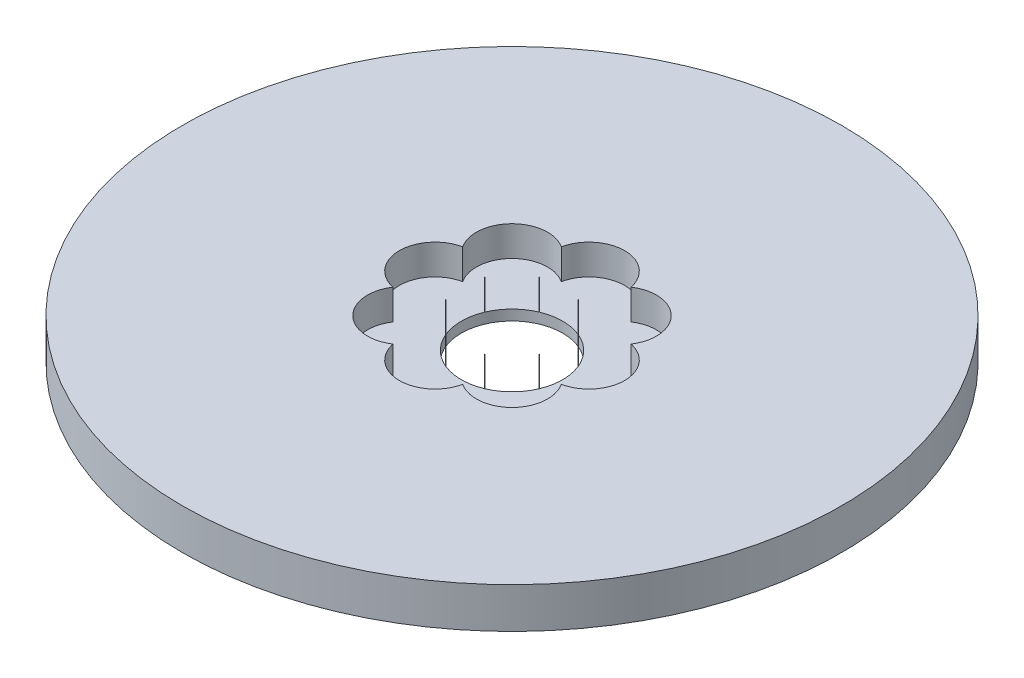
ISO-10303-21;
HEADER;
FILE_DESCRIPTION(('STEP AP214'),'2;1');
FILE_NAME('part.step','',(''),(''),'','','');
FILE_SCHEMA(('AUTOMOTIVE_DESIGN { 1 0 10303 214 1 1 1 1 }'));
ENDSEC;
DATA;
#1=APPLICATION_CONTEXT('core data for automotive mechanical design processes');
#2=APPLICATION_PROTOCOL_DEFINITION('international standard','automotive_design',2000,#1);
#3=PRODUCT_CONTEXT('',#1,'mechanical');
#4=PRODUCT('Part','Part','',(#3));
#5=PRODUCT_RELATED_PRODUCT_CATEGORY('part','',(#4));
#6=PRODUCT_DEFINITION_FORMATION('','',#4);
#7=PRODUCT_DEFINITION_CONTEXT('part definition',#1,'design');
#8=PRODUCT_DEFINITION('design','',#6,#7);
#9=PRODUCT_DEFINITION_SHAPE('','',#8);
#10=(LENGTH_UNIT() NAMED_UNIT(*) SI_UNIT(.MILLI.,.METRE.));
#11=(NAMED_UNIT(*) PLANE_ANGLE_UNIT() SI_UNIT($,.RADIAN.));
#12=(NAMED_UNIT(*) SI_UNIT($,.STERADIAN.) SOLID_ANGLE_UNIT());
#13=UNCERTAINTY_MEASURE_WITH_UNIT(LENGTH_MEASURE(1.E-05),#10,'distance_accuracy_value','');
#14=(GEOMETRIC_REPRESENTATION_CONTEXT(3) GLOBAL_UNCERTAINTY_ASSIGNED_CONTEXT((#13)) GLOBAL_UNIT_ASSIGNED_CONTEXT((#10,
#11,#12)) REPRESENTATION_CONTEXT('',''));
#15=CARTESIAN_POINT('',(0.,0.,0.));
#16=DIRECTION('',(0.,0.,1.));
#17=DIRECTION('',(1.,0.,0.));
#18=AXIS2_PLACEMENT_3D('',#15,#16,#17);
#19=CARTESIAN_POINT('',(0.,8.,0.));
#20=DIRECTION('',(0.,1.,0.));
#21=DIRECTION('',(0.,0.,1.));
#22=AXIS2_PLACEMENT_3D('',#19,#20,#21);
#23=PLANE('',#22);
#24=CARTESIAN_POINT('',(-10.7319674230691,8.,10.7319674230692));
#25=DIRECTION('',(0.,1.,0.));
#26=DIRECTION('',(0.707106781186549,0.,0.707106781186546));
#27=AXIS2_PLACEMENT_3D('',#24,#25,#26);
#28=CIRCLE('',#27,7.02657208543301);
#29=CARTESIAN_POINT('',(-9.22088080084834,8.,3.8698006740072));
#30=VERTEX_POINT('',#29);
#31=CARTESIAN_POINT('',(-9.30107521494982,8.,3.85263149868448));
#32=VERTEX_POINT('',#31);
#33=EDGE_CURVE('E380',#30,#32,#28,.T.);
#34=ORIENTED_EDGE('',*,*,#33,.F.);
#35=CARTESIAN_POINT('',(0.,8.,0.));
#36=DIRECTION('',(0.,1.,0.));
#37=DIRECTION('',(0.,0.,1.));
#38=AXIS2_PLACEMENT_3D('',#35,#36,#37);
#39=CIRCLE('',#38,10.);
#40=CARTESIAN_POINT('',(-9.25650964122346,8.,3.78378504436195));
#41=VERTEX_POINT('',#40);
#42=EDGE_CURVE('E407',#41,#30,#39,.T.);
#43=ORIENTED_EDGE('',*,*,#42,.F.);
#44=CARTESIAN_POINT('',(-15.1772938806506,8.,0.));
#45=DIRECTION('',(0.,1.,0.));
#46=DIRECTION('',(0.,0.,1.));
#47=AXIS2_PLACEMENT_3D('',#44,#45,#46);
#48=CIRCLE('',#47,7.02657208543301);
#49=EDGE_CURVE('E410',#32,#41,#48,.T.);
#50=ORIENTED_EDGE('',*,*,#49,.F.);
#51=EDGE_LOOP('',(#34,#43,#50));
#52=FACE_BOUND('',#51,.T.);
#53=ADVANCED_FACE('F39',(#52),#23,.T.);
#54=CARTESIAN_POINT('',(-10.7319674230693,8.,-10.731967423069));
#55=DIRECTION('',(0.,1.,0.));
#56=DIRECTION('',(-0.707106781186539,0.,0.707106781186556));
#57=AXIS2_PLACEMENT_3D('',#54,#55,#56);
#58=CIRCLE('',#57,7.02657208543301);
#59=CARTESIAN_POINT('',(-9.30107521494975,8.,-3.85263149868437));
#60=VERTEX_POINT('',#59);
#61=CARTESIAN_POINT('',(-9.22088080084839,8.,-3.86980067400707));
#62=VERTEX_POINT('',#61);
#63=EDGE_CURVE('E285',#60,#62,#58,.T.);
#64=ORIENTED_EDGE('',*,*,#63,.F.);
#65=CARTESIAN_POINT('',(-9.25650964122346,8.,-3.78378504436195));
#66=VERTEX_POINT('',#65);
#67=EDGE_CURVE('E401',#66,#60,#48,.T.);
#68=ORIENTED_EDGE('',*,*,#67,.F.);
#69=EDGE_CURVE('E412',#62,#66,#39,.T.);
#70=ORIENTED_EDGE('',*,*,#69,.F.);
#71=EDGE_LOOP('',(#64,#68,#70));
#72=FACE_BOUND('',#71,.T.);
#73=ADVANCED_FACE('F533',(#72),#23,.T.);
#74=CARTESIAN_POINT('',(-1.58973715075289E-13,8.,-15.1772938806506));
#75=DIRECTION('',(0.,1.,0.));
#76=DIRECTION('',(-1.,0.,0.));
#77=AXIS2_PLACEMENT_3D('',#74,#75,#76);
#78=CIRCLE('',#77,7.02657208543301);
#79=CARTESIAN_POINT('',(3.78378504436186,8.,-9.2565096412235));
#80=VERTEX_POINT('',#79);
#81=CARTESIAN_POINT('',(3.85263149868438,8.,-9.30107521494986));
#82=VERTEX_POINT('',#81);
#83=EDGE_CURVE('E301',#80,#82,#78,.T.);
#84=ORIENTED_EDGE('',*,*,#83,.F.);
#85=CARTESIAN_POINT('',(3.8698006740071,8.,-9.22088080084837));
#86=VERTEX_POINT('',#85);
#87=EDGE_CURVE('E511',#86,#80,#39,.T.);
#88=ORIENTED_EDGE('',*,*,#87,.F.);
#89=CARTESIAN_POINT('',(10.7319674230691,8.,-10.7319674230692));
#90=DIRECTION('',(0.,1.,0.));
#91=DIRECTION('',(-0.707106781186554,0.,-0.707106781186541));
#92=AXIS2_PLACEMENT_3D('',#89,#90,#91);
#93=CIRCLE('',#92,7.02657208543301);
#94=EDGE_CURVE('E313',#82,#86,#93,.T.);
#95=ORIENTED_EDGE('',*,*,#94,.F.);
#96=EDGE_LOOP('',(#84,#88,#95));
#97=FACE_BOUND('',#96,.T.);
#98=ADVANCED_FACE('F574',(#97),#23,.T.);
#99=CARTESIAN_POINT('',(9.2208808008483,8.,-3.86980067400727));
#100=VERTEX_POINT('',#99);
#101=CARTESIAN_POINT('',(9.30107521494986,8.,-3.85263149868453));
#102=VERTEX_POINT('',#101);
#103=EDGE_CURVE('E315',#100,#102,#93,.T.);
#104=ORIENTED_EDGE('',*,*,#103,.F.);
#105=CARTESIAN_POINT('',(9.25650964122346,8.,-3.78378504436196));
#106=VERTEX_POINT('',#105);
#107=EDGE_CURVE('E512',#106,#100,#39,.T.);
#108=ORIENTED_EDGE('',*,*,#107,.F.);
#109=CARTESIAN_POINT('',(15.1772938806506,8.,0.));
#110=DIRECTION('',(0.,1.,0.));
#111=DIRECTION('',(0.,0.,-1.));
#112=AXIS2_PLACEMENT_3D('',#109,#110,#111);
#113=CIRCLE('',#112,7.02657208543301);
#114=EDGE_CURVE('E324',#102,#106,#113,.T.);
#115=ORIENTED_EDGE('',*,*,#114,.F.);
#116=EDGE_LOOP('',(#104,#108,#115));
#117=FACE_BOUND('',#116,.T.);
#118=ADVANCED_FACE('F597',(#117),#23,.T.);
#119=CARTESIAN_POINT('',(9.25650964122346,8.,3.78378504436195));
#120=VERTEX_POINT('',#119);
#121=CARTESIAN_POINT('',(9.30107521494979,8.,3.85263149868442));
#122=VERTEX_POINT('',#121);
#123=EDGE_CURVE('E330',#120,#122,#113,.T.);
#124=ORIENTED_EDGE('',*,*,#123,.F.);
#125=CARTESIAN_POINT('',(9.22088080084836,8.,3.86980067400714));
#126=VERTEX_POINT('',#125);
#127=EDGE_CURVE('E502',#126,#120,#39,.T.);
#128=ORIENTED_EDGE('',*,*,#127,.F.);
#129=CARTESIAN_POINT('',(10.7319674230692,8.,10.7319674230691));
#130=DIRECTION('',(0.,1.,0.));
#131=DIRECTION('',(0.707106781186544,0.,-0.707106781186551));
#132=AXIS2_PLACEMENT_3D('',#129,#130,#131);
#133=CIRCLE('',#132,7.02657208543301);
#134=EDGE_CURVE('E336',#122,#126,#133,.T.);
#135=ORIENTED_EDGE('',*,*,#134,.F.);
#136=EDGE_LOOP('',(#124,#128,#135));
#137=FACE_BOUND('',#136,.T.);
#138=ADVANCED_FACE('F505',(#137),#23,.T.);
#139=CARTESIAN_POINT('',(3.86980067400723,8.,9.22088080084832));
#140=VERTEX_POINT('',#139);
#141=CARTESIAN_POINT('',(3.85263149868451,8.,9.30107521494981));
#142=VERTEX_POINT('',#141);
#143=EDGE_CURVE('E325',#140,#142,#133,.T.);
#144=ORIENTED_EDGE('',*,*,#143,.F.);
#145=CARTESIAN_POINT('',(3.78378504436198,8.,9.25650964122345));
#146=VERTEX_POINT('',#145);
#147=EDGE_CURVE('E509',#146,#140,#39,.T.);
#148=ORIENTED_EDGE('',*,*,#147,.F.);
#149=CARTESIAN_POINT('',(0.,8.,15.1772938806506));
#150=DIRECTION('',(0.,1.,0.));
#151=DIRECTION('',(1.,0.,0.));
#152=AXIS2_PLACEMENT_3D('',#149,#150,#151);
#153=CIRCLE('',#152,7.02657208543301);
#154=EDGE_CURVE('E349',#142,#146,#153,.T.);
#155=ORIENTED_EDGE('',*,*,#154,.F.);
#156=EDGE_LOOP('',(#144,#148,#155));
#157=FACE_BOUND('',#156,.T.);
#158=ADVANCED_FACE('F508',(#157),#23,.T.);
#159=CARTESIAN_POINT('',(-3.78378504436192,8.,9.25650964122347));
#160=VERTEX_POINT('',#159);
#161=CARTESIAN_POINT('',(-3.85263149868444,8.,9.30107521494983));
#162=VERTEX_POINT('',#161);
#163=EDGE_CURVE('E351',#160,#162,#153,.T.);
#164=ORIENTED_EDGE('',*,*,#163,.F.);
#165=CARTESIAN_POINT('',(-3.86980067400717,8.,9.22088080084835));
#166=VERTEX_POINT('',#165);
#167=EDGE_CURVE('E415',#166,#160,#39,.T.);
#168=ORIENTED_EDGE('',*,*,#167,.F.);
#169=EDGE_CURVE('E374',#162,#166,#28,.T.);
#170=ORIENTED_EDGE('',*,*,#169,.F.);
#171=EDGE_LOOP('',(#164,#168,#170));
#172=FACE_BOUND('',#171,.T.);
#173=ADVANCED_FACE('F467',(#172),#23,.T.);
#174=CARTESIAN_POINT('',(-3.85263149868457,8.,-9.30107521494978));
#175=VERTEX_POINT('',#174);
#176=CARTESIAN_POINT('',(-3.78378504436205,8.,-9.25650964122342));
#177=VERTEX_POINT('',#176);
#178=EDGE_CURVE('E257',#175,#177,#78,.T.);
#179=ORIENTED_EDGE('',*,*,#178,.F.);
#180=CARTESIAN_POINT('',(-3.8698006740073,8.,-9.2208808008483));
#181=VERTEX_POINT('',#180);
#182=EDGE_CURVE('E282',#181,#175,#58,.T.);
#183=ORIENTED_EDGE('',*,*,#182,.F.);
#184=EDGE_CURVE('E299',#177,#181,#39,.T.);
#185=ORIENTED_EDGE('',*,*,#184,.F.);
#186=EDGE_LOOP('',(#179,#183,#185));
#187=FACE_BOUND('',#186,.T.);
#188=ADVANCED_FACE('F298',(#187),#23,.T.);
#189=CARTESIAN_POINT('',(-15.1772938806506,2.0509225260186,0.));
#190=DIRECTION('',(0.,1.,0.));
#191=DIRECTION('',(0.,0.,1.));
#192=AXIS2_PLACEMENT_3D('',#189,#190,#191);
#193=CYLINDRICAL_SURFACE('',#192,7.02657208543301);
#194=CARTESIAN_POINT('',(-15.1772938806506,2.0509225260186,0.));
#195=DIRECTION('',(0.,1.,0.));
#196=DIRECTION('',(0.,0.,1.));
#197=AXIS2_PLACEMENT_3D('',#194,#195,#196);
#198=CIRCLE('',#197,7.02657208543301);
#199=CARTESIAN_POINT('',(-9.30107521494982,2.0509225260186,3.85263149868448));
#200=VERTEX_POINT('',#199);
#201=CARTESIAN_POINT('',(-9.25650964122346,2.0509225260186,3.78378504436195));
#202=VERTEX_POINT('',#201);
#203=EDGE_CURVE('E65',#200,#202,#198,.T.);
#204=ORIENTED_EDGE('',*,*,#203,.F.);
#205=DIRECTION('',(0.,1.,0.));
#206=VECTOR('',#205,1.);
#207=CARTESIAN_POINT('',(-9.30107521494982,5.0254612630093,3.85263149868448));
#208=LINE('',#207,#206);
#209=EDGE_CURVE('E387',#200,#32,#208,.T.);
#210=ORIENTED_EDGE('',*,*,#209,.T.);
#211=ORIENTED_EDGE('',*,*,#49,.T.);
#212=DIRECTION('',(0.,1.,0.));
#213=VECTOR('',#212,1.);
#214=CARTESIAN_POINT('',(-9.25650964122346,5.0254612630093,3.78378504436195));
#215=LINE('',#214,#213);
#216=EDGE_CURVE('E424',#41,#202,#215,.F.);
#217=ORIENTED_EDGE('',*,*,#216,.T.);
#218=EDGE_LOOP('',(#204,#210,#211,#217));
#219=FACE_BOUND('',#218,.T.);
#220=ADVANCED_FACE('F590',(#219),#193,.F.);
#221=CARTESIAN_POINT('',(-16.6081860887702,8.,-6.87933592438465));
#222=VERTEX_POINT('',#221);
#223=CARTESIAN_POINT('',(-16.6081860887699,8.,6.87933592438469));
#224=VERTEX_POINT('',#223);
#225=EDGE_CURVE('E406',#222,#224,#48,.T.);
#226=ORIENTED_EDGE('',*,*,#225,.T.);
#227=DIRECTION('',(0.,1.,0.));
#228=VECTOR('',#227,1.);
#229=CARTESIAN_POINT('',(-16.6081860887699,5.0254612630093,6.87933592438469));
#230=LINE('',#229,#228);
#231=CARTESIAN_POINT('',(-16.6081860887699,2.0509225260186,6.87933592438469));
#232=VERTEX_POINT('',#231);
#233=EDGE_CURVE('E382',#224,#232,#230,.F.);
#234=ORIENTED_EDGE('',*,*,#233,.T.);
#235=CARTESIAN_POINT('',(-16.6081860887702,2.0509225260186,-6.87933592438465));
#236=VERTEX_POINT('',#235);
#237=EDGE_CURVE('E405',#236,#232,#198,.T.);
#238=ORIENTED_EDGE('',*,*,#237,.F.);
#239=DIRECTION('',(0.,1.,0.));
#240=VECTOR('',#239,1.);
#241=CARTESIAN_POINT('',(-16.6081860887702,5.0254612630093,-6.87933592438465));
#242=LINE('',#241,#240);
#243=EDGE_CURVE('E273',#236,#222,#242,.T.);
#244=ORIENTED_EDGE('',*,*,#243,.T.);
#245=EDGE_LOOP('',(#226,#234,#238,#244));
#246=FACE_BOUND('',#245,.T.);
#247=ADVANCED_FACE('F544',(#246),#193,.F.);
#248=CARTESIAN_POINT('',(0.,8.,0.));
#249=DIRECTION('',(0.,-1.,0.));
#250=DIRECTION('',(0.,0.,-1.));
#251=AXIS2_PLACEMENT_3D('',#248,#249,#250);
#252=CYLINDRICAL_SURFACE('',#251,65.);
#253=CARTESIAN_POINT('',(0.,8.,0.));
#254=DIRECTION('',(0.,1.,0.));
#255=DIRECTION('',(0.,0.,1.));
#256=AXIS2_PLACEMENT_3D('',#253,#254,#255);
#257=CIRCLE('',#256,65.);
#258=CARTESIAN_POINT('',(0.,8.,65.));
#259=VERTEX_POINT('',#258);
#260=EDGE_CURVE('E418',#259,#259,#257,.T.);
#261=ORIENTED_EDGE('',*,*,#260,.F.);
#262=EDGE_LOOP('',(#261));
#263=FACE_BOUND('',#262,.T.);
#264=CARTESIAN_POINT('',(0.,0.,0.));
#265=DIRECTION('',(0.,1.,0.));
#266=DIRECTION('',(0.,0.,1.));
#267=AXIS2_PLACEMENT_3D('',#264,#265,#266);
#268=CIRCLE('',#267,65.);
#269=CARTESIAN_POINT('',(0.,0.,65.));
#270=VERTEX_POINT('',#269);
#271=EDGE_CURVE('E411',#270,#270,#268,.T.);
#272=ORIENTED_EDGE('',*,*,#271,.T.);
#273=EDGE_LOOP('',(#272));
#274=FACE_BOUND('',#273,.T.);
#275=ADVANCED_FACE('F41',(#263,#274),#252,.T.);
#276=CARTESIAN_POINT('',(-6.87933592438463,8.,16.60818608877));
#277=VERTEX_POINT('',#276);
#278=EDGE_CURVE('E366',#224,#277,#28,.T.);
#279=ORIENTED_EDGE('',*,*,#278,.F.);
#280=ORIENTED_EDGE('',*,*,#225,.F.);
#281=CARTESIAN_POINT('',(-6.87933592438487,8.,-16.6081860887699));
#282=VERTEX_POINT('',#281);
#283=EDGE_CURVE('E279',#282,#222,#58,.T.);
#284=ORIENTED_EDGE('',*,*,#283,.F.);
#285=CARTESIAN_POINT('',(6.87933592438452,8.,-16.60818608877));
#286=VERTEX_POINT('',#285);
#287=EDGE_CURVE('E270',#286,#282,#78,.T.);
#288=ORIENTED_EDGE('',*,*,#287,.F.);
#289=CARTESIAN_POINT('',(16.6081860887698,8.,-6.87933592438471));
#290=VERTEX_POINT('',#289);
#291=EDGE_CURVE('E306',#290,#286,#93,.T.);
#292=ORIENTED_EDGE('',*,*,#291,.F.);
#293=CARTESIAN_POINT('',(16.60818608877,8.,6.87933592438467));
#294=VERTEX_POINT('',#293);
#295=EDGE_CURVE('E318',#294,#290,#113,.T.);
#296=ORIENTED_EDGE('',*,*,#295,.F.);
#297=CARTESIAN_POINT('',(6.87933592438475,8.,16.6081860887699));
#298=VERTEX_POINT('',#297);
#299=EDGE_CURVE('E334',#298,#294,#133,.T.);
#300=ORIENTED_EDGE('',*,*,#299,.F.);
#301=EDGE_CURVE('E345',#277,#298,#153,.T.);
#302=ORIENTED_EDGE('',*,*,#301,.F.);
#303=EDGE_LOOP('',(#279,#280,#284,#288,#292,#296,#300,#302));
#304=FACE_BOUND('',#303,.T.);
#305=ORIENTED_EDGE('',*,*,#260,.T.);
#306=EDGE_LOOP('',(#305));
#307=FACE_BOUND('',#306,.T.);
#308=ADVANCED_FACE('F485',(#304,#307),#23,.T.);
#309=CARTESIAN_POINT('',(0.,0.,0.));
#310=DIRECTION('',(0.,1.,0.));
#311=DIRECTION('',(0.,0.,1.));
#312=AXIS2_PLACEMENT_3D('',#309,#310,#311);
#313=PLANE('',#312);
#314=CARTESIAN_POINT('',(0.,0.,0.));
#315=DIRECTION('',(0.,1.,0.));
#316=DIRECTION('',(0.,0.,1.));
#317=AXIS2_PLACEMENT_3D('',#314,#315,#316);
#318=CIRCLE('',#317,10.);
#319=CARTESIAN_POINT('',(0.,0.,10.));
#320=VERTEX_POINT('',#319);
#321=EDGE_CURVE('E402',#320,#320,#318,.T.);
#322=ORIENTED_EDGE('',*,*,#321,.T.);
#323=EDGE_LOOP('',(#322));
#324=FACE_BOUND('',#323,.T.);
#325=ORIENTED_EDGE('',*,*,#271,.F.);
#326=EDGE_LOOP('',(#325));
#327=FACE_BOUND('',#326,.T.);
#328=ADVANCED_FACE('F577',(#324,#327),#313,.F.);
#329=CARTESIAN_POINT('',(0.,8.,0.));
#330=DIRECTION('',(0.,-1.,0.));
#331=DIRECTION('',(0.,0.,-1.));
#332=AXIS2_PLACEMENT_3D('',#329,#330,#331);
#333=CYLINDRICAL_SURFACE('',#332,10.);
#334=DIRECTION('',(0.,1.,0.));
#335=VECTOR('',#334,1.);
#336=CARTESIAN_POINT('',(-9.22088080084833,5.0254612630093,3.8698006740072));
#337=LINE('',#336,#335);
#338=CARTESIAN_POINT('',(-9.22088080084834,2.0509225260186,3.8698006740072));
#339=VERTEX_POINT('',#338);
#340=EDGE_CURVE('E391',#339,#30,#337,.T.);
#341=ORIENTED_EDGE('',*,*,#340,.F.);
#342=CARTESIAN_POINT('',(0.,2.0509225260186,0.));
#343=DIRECTION('',(0.,1.,0.));
#344=DIRECTION('',(0.,0.,1.));
#345=AXIS2_PLACEMENT_3D('',#342,#343,#344);
#346=CIRCLE('',#345,10.);
#347=CARTESIAN_POINT('',(-3.86980067400717,2.0509225260186,9.22088080084835));
#348=VERTEX_POINT('',#347);
#349=EDGE_CURVE('E396',#339,#348,#346,.T.);
#350=ORIENTED_EDGE('',*,*,#349,.T.);
#351=DIRECTION('',(0.,1.,0.));
#352=VECTOR('',#351,1.);
#353=CARTESIAN_POINT('',(-3.86980067400717,5.0254612630093,9.22088080084835));
#354=LINE('',#353,#352);
#355=EDGE_CURVE('E386',#166,#348,#354,.F.);
#356=ORIENTED_EDGE('',*,*,#355,.F.);
#357=ORIENTED_EDGE('',*,*,#167,.T.);
#358=DIRECTION('',(0.,1.,0.));
#359=VECTOR('',#358,1.);
#360=CARTESIAN_POINT('',(-3.78378504436192,5.0254612630093,9.25650964122347));
#361=LINE('',#360,#359);
#362=CARTESIAN_POINT('',(-3.78378504436192,2.0509225260186,9.25650964122347));
#363=VERTEX_POINT('',#362);
#364=EDGE_CURVE('E11',#363,#160,#361,.T.);
#365=ORIENTED_EDGE('',*,*,#364,.F.);
#366=CARTESIAN_POINT('',(3.78378504436198,2.0509225260186,9.25650964122345));
#367=VERTEX_POINT('',#366);
#368=EDGE_CURVE('E392',#363,#367,#346,.T.);
#369=ORIENTED_EDGE('',*,*,#368,.T.);
#370=DIRECTION('',(0.,1.,0.));
#371=VECTOR('',#370,1.);
#372=CARTESIAN_POINT('',(3.78378504436199,5.0254612630093,9.25650964122345));
#373=LINE('',#372,#371);
#374=EDGE_CURVE('E50',#146,#367,#373,.F.);
#375=ORIENTED_EDGE('',*,*,#374,.F.);
#376=ORIENTED_EDGE('',*,*,#147,.T.);
#377=DIRECTION('',(0.,1.,0.));
#378=VECTOR('',#377,1.);
#379=CARTESIAN_POINT('',(3.86980067400723,5.0254612630093,9.22088080084832));
#380=LINE('',#379,#378);
#381=CARTESIAN_POINT('',(3.86980067400723,2.0509225260186,9.22088080084832));
#382=VERTEX_POINT('',#381);
#383=EDGE_CURVE('E438',#382,#140,#380,.T.);
#384=ORIENTED_EDGE('',*,*,#383,.F.);
#385=CARTESIAN_POINT('',(9.22088080084836,2.0509225260186,3.86980067400714));
#386=VERTEX_POINT('',#385);
#387=EDGE_CURVE('E400',#382,#386,#346,.T.);
#388=ORIENTED_EDGE('',*,*,#387,.T.);
#389=DIRECTION('',(0.,1.,0.));
#390=VECTOR('',#389,1.);
#391=CARTESIAN_POINT('',(9.22088080084836,5.0254612630093,3.86980067400714));
#392=LINE('',#391,#390);
#393=EDGE_CURVE('E440',#126,#386,#392,.F.);
#394=ORIENTED_EDGE('',*,*,#393,.F.);
#395=ORIENTED_EDGE('',*,*,#127,.T.);
#396=DIRECTION('',(0.,1.,0.));
#397=VECTOR('',#396,1.);
#398=CARTESIAN_POINT('',(9.25650964122346,5.0254612630093,3.78378504436195));
#399=LINE('',#398,#397);
#400=CARTESIAN_POINT('',(9.25650964122346,2.0509225260186,3.78378504436195));
#401=VERTEX_POINT('',#400);
#402=EDGE_CURVE('E434',#401,#120,#399,.T.);
#403=ORIENTED_EDGE('',*,*,#402,.F.);
#404=CARTESIAN_POINT('',(9.25650964122346,2.0509225260186,-3.78378504436196));
#405=VERTEX_POINT('',#404);
#406=EDGE_CURVE('E550',#401,#405,#346,.T.);
#407=ORIENTED_EDGE('',*,*,#406,.T.);
#408=DIRECTION('',(0.,1.,0.));
#409=VECTOR('',#408,1.);
#410=CARTESIAN_POINT('',(9.25650964122346,5.0254612630093,-3.78378504436195));
#411=LINE('',#410,#409);
#412=EDGE_CURVE('E433',#106,#405,#411,.F.);
#413=ORIENTED_EDGE('',*,*,#412,.F.);
#414=ORIENTED_EDGE('',*,*,#107,.T.);
#415=DIRECTION('',(0.,1.,0.));
#416=VECTOR('',#415,1.);
#417=CARTESIAN_POINT('',(9.22088080084831,5.0254612630093,-3.86980067400727));
#418=LINE('',#417,#416);
#419=CARTESIAN_POINT('',(9.2208808008483,2.0509225260186,-3.86980067400727));
#420=VERTEX_POINT('',#419);
#421=EDGE_CURVE('E444',#420,#100,#418,.T.);
#422=ORIENTED_EDGE('',*,*,#421,.F.);
#423=CARTESIAN_POINT('',(3.8698006740071,2.0509225260186,-9.22088080084837));
#424=VERTEX_POINT('',#423);
#425=EDGE_CURVE('E548',#420,#424,#346,.T.);
#426=ORIENTED_EDGE('',*,*,#425,.T.);
#427=DIRECTION('',(0.,1.,0.));
#428=VECTOR('',#427,1.);
#429=CARTESIAN_POINT('',(3.8698006740071,5.0254612630093,-9.22088080084837));
#430=LINE('',#429,#428);
#431=EDGE_CURVE('E442',#86,#424,#430,.F.);
#432=ORIENTED_EDGE('',*,*,#431,.F.);
#433=ORIENTED_EDGE('',*,*,#87,.T.);
#434=DIRECTION('',(0.,1.,0.));
#435=VECTOR('',#434,1.);
#436=CARTESIAN_POINT('',(3.78378504436186,5.0254612630093,-9.2565096412235));
#437=LINE('',#436,#435);
#438=CARTESIAN_POINT('',(3.78378504436186,2.0509225260186,-9.2565096412235));
#439=VERTEX_POINT('',#438);
#440=EDGE_CURVE('E431',#439,#80,#437,.T.);
#441=ORIENTED_EDGE('',*,*,#440,.F.);
#442=CARTESIAN_POINT('',(-3.78378504436205,2.0509225260186,-9.25650964122342));
#443=VERTEX_POINT('',#442);
#444=EDGE_CURVE('E552',#439,#443,#346,.T.);
#445=ORIENTED_EDGE('',*,*,#444,.T.);
#446=DIRECTION('',(0.,1.,0.));
#447=VECTOR('',#446,1.);
#448=CARTESIAN_POINT('',(-3.78378504436205,5.0254612630093,-9.25650964122342));
#449=LINE('',#448,#447);
#450=EDGE_CURVE('E427',#177,#443,#449,.F.);
#451=ORIENTED_EDGE('',*,*,#450,.F.);
#452=ORIENTED_EDGE('',*,*,#184,.T.);
#453=DIRECTION('',(0.,1.,0.));
#454=VECTOR('',#453,1.);
#455=CARTESIAN_POINT('',(-3.8698006740073,5.0254612630093,-9.2208808008483));
#456=LINE('',#455,#454);
#457=CARTESIAN_POINT('',(-3.8698006740073,2.0509225260186,-9.2208808008483));
#458=VERTEX_POINT('',#457);
#459=EDGE_CURVE('E289',#458,#181,#456,.T.);
#460=ORIENTED_EDGE('',*,*,#459,.F.);
#461=CARTESIAN_POINT('',(-9.22088080084839,2.0509225260186,-3.86980067400707));
#462=VERTEX_POINT('',#461);
#463=EDGE_CURVE('E554',#458,#462,#346,.T.);
#464=ORIENTED_EDGE('',*,*,#463,.T.);
#465=DIRECTION('',(0.,1.,0.));
#466=VECTOR('',#465,1.);
#467=CARTESIAN_POINT('',(-9.22088080084839,5.0254612630093,-3.86980067400707));
#468=LINE('',#467,#466);
#469=EDGE_CURVE('E379',#62,#462,#468,.F.);
#470=ORIENTED_EDGE('',*,*,#469,.F.);
#471=ORIENTED_EDGE('',*,*,#69,.T.);
#472=DIRECTION('',(0.,1.,0.));
#473=VECTOR('',#472,1.);
#474=CARTESIAN_POINT('',(-9.25650964122346,5.0254612630093,-3.78378504436195));
#475=LINE('',#474,#473);
#476=CARTESIAN_POINT('',(-9.25650964122346,2.0509225260186,-3.78378504436195));
#477=VERTEX_POINT('',#476);
#478=EDGE_CURVE('E426',#477,#66,#475,.T.);
#479=ORIENTED_EDGE('',*,*,#478,.F.);
#480=CARTESIAN_POINT('',(0.,2.0509225260186,0.));
#481=DIRECTION('',(0.,1.,0.));
#482=DIRECTION('',(0.,0.,1.));
#483=AXIS2_PLACEMENT_3D('',#480,#481,#482);
#484=CIRCLE('',#483,10.);
#485=EDGE_CURVE('E420',#477,#202,#484,.T.);
#486=ORIENTED_EDGE('',*,*,#485,.T.);
#487=ORIENTED_EDGE('',*,*,#216,.F.);
#488=ORIENTED_EDGE('',*,*,#42,.T.);
#489=EDGE_LOOP('',(#341,#350,#356,#357,#365,#369,#375,#376,#384,#388,#394,#395,#403,#407,#413,
#414,#422,#426,#432,#433,#441,#445,#451,#452,#460,#464,#470,#471,#479,#486,#487,#488));
#490=FACE_BOUND('',#489,.T.);
#491=ORIENTED_EDGE('',*,*,#321,.F.);
#492=EDGE_LOOP('',(#491));
#493=FACE_BOUND('',#492,.T.);
#494=ADVANCED_FACE('F460',(#490,#493),#333,.F.);
#495=ORIENTED_EDGE('',*,*,#67,.T.);
#496=DIRECTION('',(0.,1.,0.));
#497=VECTOR('',#496,1.);
#498=CARTESIAN_POINT('',(-9.30107521494975,5.0254612630093,-3.85263149868437));
#499=LINE('',#498,#497);
#500=CARTESIAN_POINT('',(-9.30107521494975,2.0509225260186,-3.85263149868437));
#501=VERTEX_POINT('',#500);
#502=EDGE_CURVE('E375',#60,#501,#499,.F.);
#503=ORIENTED_EDGE('',*,*,#502,.T.);
#504=EDGE_CURVE('E397',#477,#501,#198,.T.);
#505=ORIENTED_EDGE('',*,*,#504,.F.);
#506=ORIENTED_EDGE('',*,*,#478,.T.);
#507=EDGE_LOOP('',(#495,#503,#505,#506));
#508=FACE_BOUND('',#507,.T.);
#509=ADVANCED_FACE('F529',(#508),#193,.F.);
#510=CARTESIAN_POINT('',(-15.1772938806506,2.0509225260186,0.));
#511=DIRECTION('',(0.,1.,0.));
#512=DIRECTION('',(0.,0.,1.));
#513=AXIS2_PLACEMENT_3D('',#510,#511,#512);
#514=PLANE('',#513);
#515=CARTESIAN_POINT('',(-10.7319674230693,2.0509225260186,-10.731967423069));
#516=DIRECTION('',(0.,1.,0.));
#517=DIRECTION('',(-0.707106781186539,0.,0.707106781186556));
#518=AXIS2_PLACEMENT_3D('',#515,#516,#517);
#519=CIRCLE('',#518,7.02657208543301);
#520=CARTESIAN_POINT('',(-6.87933592438487,2.0509225260186,-16.6081860887699));
#521=VERTEX_POINT('',#520);
#522=EDGE_CURVE('E251',#521,#236,#519,.T.);
#523=ORIENTED_EDGE('',*,*,#522,.T.);
#524=ORIENTED_EDGE('',*,*,#237,.T.);
#525=CARTESIAN_POINT('',(-10.7319674230691,2.0509225260186,10.7319674230692));
#526=DIRECTION('',(0.,1.,0.));
#527=DIRECTION('',(0.707106781186549,0.,0.707106781186546));
#528=AXIS2_PLACEMENT_3D('',#525,#526,#527);
#529=CIRCLE('',#528,7.02657208543301);
#530=CARTESIAN_POINT('',(-6.87933592438463,2.0509225260186,16.60818608877));
#531=VERTEX_POINT('',#530);
#532=EDGE_CURVE('E372',#232,#531,#529,.T.);
#533=ORIENTED_EDGE('',*,*,#532,.T.);
#534=CARTESIAN_POINT('',(0.,2.0509225260186,15.1772938806506));
#535=DIRECTION('',(0.,1.,0.));
#536=DIRECTION('',(1.,0.,0.));
#537=AXIS2_PLACEMENT_3D('',#534,#535,#536);
#538=CIRCLE('',#537,7.02657208543301);
#539=CARTESIAN_POINT('',(6.87933592438475,2.0509225260186,16.6081860887699));
#540=VERTEX_POINT('',#539);
#541=EDGE_CURVE('E346',#531,#540,#538,.T.);
#542=ORIENTED_EDGE('',*,*,#541,.T.);
#543=CARTESIAN_POINT('',(10.7319674230692,2.0509225260186,10.7319674230691));
#544=DIRECTION('',(0.,1.,0.));
#545=DIRECTION('',(0.707106781186544,0.,-0.707106781186551));
#546=AXIS2_PLACEMENT_3D('',#543,#544,#545);
#547=CIRCLE('',#546,7.02657208543301);
#548=CARTESIAN_POINT('',(16.60818608877,2.0509225260186,6.87933592438467));
#549=VERTEX_POINT('',#548);
#550=EDGE_CURVE('E327',#540,#549,#547,.T.);
#551=ORIENTED_EDGE('',*,*,#550,.T.);
#552=CARTESIAN_POINT('',(15.1772938806506,2.0509225260186,0.));
#553=DIRECTION('',(0.,1.,0.));
#554=DIRECTION('',(0.,0.,-1.));
#555=AXIS2_PLACEMENT_3D('',#552,#553,#554);
#556=CIRCLE('',#555,7.02657208543301);
#557=CARTESIAN_POINT('',(16.6081860887698,2.0509225260186,-6.87933592438472));
#558=VERTEX_POINT('',#557);
#559=EDGE_CURVE('E322',#549,#558,#556,.T.);
#560=ORIENTED_EDGE('',*,*,#559,.T.);
#561=CARTESIAN_POINT('',(10.7319674230691,2.0509225260186,-10.7319674230692));
#562=DIRECTION('',(0.,1.,0.));
#563=DIRECTION('',(-0.707106781186554,0.,-0.707106781186541));
#564=AXIS2_PLACEMENT_3D('',#561,#562,#563);
#565=CIRCLE('',#564,7.02657208543301);
#566=CARTESIAN_POINT('',(6.87933592438452,2.0509225260186,-16.60818608877));
#567=VERTEX_POINT('',#566);
#568=EDGE_CURVE('E258',#558,#567,#565,.T.);
#569=ORIENTED_EDGE('',*,*,#568,.T.);
#570=CARTESIAN_POINT('',(-1.58973715075289E-13,2.0509225260186,-15.1772938806506));
#571=DIRECTION('',(0.,1.,0.));
#572=DIRECTION('',(-1.,0.,0.));
#573=AXIS2_PLACEMENT_3D('',#570,#571,#572);
#574=CIRCLE('',#573,7.02657208543301);
#575=EDGE_CURVE('E247',#567,#521,#574,.T.);
#576=ORIENTED_EDGE('',*,*,#575,.T.);
#577=EDGE_LOOP('',(#523,#524,#533,#542,#551,#560,#569,#576));
#578=FACE_BOUND('',#577,.T.);
#579=ORIENTED_EDGE('',*,*,#504,.T.);
#580=EDGE_CURVE('E53',#501,#462,#519,.T.);
#581=ORIENTED_EDGE('',*,*,#580,.T.);
#582=ORIENTED_EDGE('',*,*,#463,.F.);
#583=CARTESIAN_POINT('',(-3.85263149868457,2.0509225260186,-9.30107521494978));
#584=VERTEX_POINT('',#583);
#585=EDGE_CURVE('E277',#458,#584,#519,.T.);
#586=ORIENTED_EDGE('',*,*,#585,.T.);
#587=EDGE_CURVE('E265',#584,#443,#574,.T.);
#588=ORIENTED_EDGE('',*,*,#587,.T.);
#589=ORIENTED_EDGE('',*,*,#444,.F.);
#590=CARTESIAN_POINT('',(3.85263149868438,2.0509225260186,-9.30107521494986));
#591=VERTEX_POINT('',#590);
#592=EDGE_CURVE('E259',#439,#591,#574,.T.);
#593=ORIENTED_EDGE('',*,*,#592,.T.);
#594=EDGE_CURVE('E308',#591,#424,#565,.T.);
#595=ORIENTED_EDGE('',*,*,#594,.T.);
#596=ORIENTED_EDGE('',*,*,#425,.F.);
#597=CARTESIAN_POINT('',(9.30107521494986,2.0509225260186,-3.85263149868453));
#598=VERTEX_POINT('',#597);
#599=EDGE_CURVE('E307',#420,#598,#565,.T.);
#600=ORIENTED_EDGE('',*,*,#599,.T.);
#601=EDGE_CURVE('E317',#598,#405,#556,.T.);
#602=ORIENTED_EDGE('',*,*,#601,.T.);
#603=ORIENTED_EDGE('',*,*,#406,.F.);
#604=CARTESIAN_POINT('',(9.30107521494979,2.0509225260186,3.85263149868442));
#605=VERTEX_POINT('',#604);
#606=EDGE_CURVE('E323',#401,#605,#556,.T.);
#607=ORIENTED_EDGE('',*,*,#606,.T.);
#608=EDGE_CURVE('E332',#605,#386,#547,.T.);
#609=ORIENTED_EDGE('',*,*,#608,.T.);
#610=ORIENTED_EDGE('',*,*,#387,.F.);
#611=CARTESIAN_POINT('',(3.85263149868451,2.0509225260186,9.30107521494981));
#612=VERTEX_POINT('',#611);
#613=EDGE_CURVE('E335',#382,#612,#547,.T.);
#614=ORIENTED_EDGE('',*,*,#613,.T.);
#615=EDGE_CURVE('E342',#612,#367,#538,.T.);
#616=ORIENTED_EDGE('',*,*,#615,.T.);
#617=ORIENTED_EDGE('',*,*,#368,.F.);
#618=CARTESIAN_POINT('',(-3.85263149868444,2.0509225260186,9.30107521494983));
#619=VERTEX_POINT('',#618);
#620=EDGE_CURVE('E350',#363,#619,#538,.T.);
#621=ORIENTED_EDGE('',*,*,#620,.T.);
#622=EDGE_CURVE('E369',#619,#348,#529,.T.);
#623=ORIENTED_EDGE('',*,*,#622,.T.);
#624=ORIENTED_EDGE('',*,*,#349,.F.);
#625=EDGE_CURVE('E373',#339,#200,#529,.T.);
#626=ORIENTED_EDGE('',*,*,#625,.T.);
#627=ORIENTED_EDGE('',*,*,#203,.T.);
#628=ORIENTED_EDGE('',*,*,#485,.F.);
#629=EDGE_LOOP('',(#579,#581,#582,#586,#588,#589,#593,#595,#596,#600,#602,#603,#607,#609,#610,
#614,#616,#617,#621,#623,#624,#626,#627,#628));
#630=FACE_BOUND('',#629,.T.);
#631=ADVANCED_FACE('F249',(#578,#630),#514,.T.);
#632=CARTESIAN_POINT('',(0.,2.0509225260186,15.1772938806506));
#633=DIRECTION('',(0.,1.,0.));
#634=DIRECTION('',(0.,0.,1.));
#635=AXIS2_PLACEMENT_3D('',#632,#633,#634);
#636=CYLINDRICAL_SURFACE('',#635,7.02657208543301);
#637=ORIENTED_EDGE('',*,*,#364,.T.);
#638=ORIENTED_EDGE('',*,*,#163,.T.);
#639=DIRECTION('',(0.,1.,0.));
#640=VECTOR('',#639,1.);
#641=CARTESIAN_POINT('',(-3.85263149868444,5.0254612630093,9.30107521494983));
#642=LINE('',#641,#640);
#643=EDGE_CURVE('E364',#619,#162,#642,.T.);
#644=ORIENTED_EDGE('',*,*,#643,.F.);
#645=ORIENTED_EDGE('',*,*,#620,.F.);
#646=EDGE_LOOP('',(#637,#638,#644,#645));
#647=FACE_BOUND('',#646,.T.);
#648=ADVANCED_FACE('F463',(#647),#636,.F.);
#649=CARTESIAN_POINT('',(10.7319674230691,2.0509225260186,-10.7319674230692));
#650=DIRECTION('',(0.,1.,0.));
#651=DIRECTION('',(0.,0.,1.));
#652=AXIS2_PLACEMENT_3D('',#649,#650,#651);
#653=CYLINDRICAL_SURFACE('',#652,7.02657208543301);
#654=ORIENTED_EDGE('',*,*,#421,.T.);
#655=ORIENTED_EDGE('',*,*,#103,.T.);
#656=DIRECTION('',(0.,1.,0.));
#657=VECTOR('',#656,1.);
#658=CARTESIAN_POINT('',(9.30107521494986,5.0254612630093,-3.85263149868453));
#659=LINE('',#658,#657);
#660=EDGE_CURVE('E312',#598,#102,#659,.T.);
#661=ORIENTED_EDGE('',*,*,#660,.F.);
#662=ORIENTED_EDGE('',*,*,#599,.F.);
#663=EDGE_LOOP('',(#654,#655,#661,#662));
#664=FACE_BOUND('',#663,.T.);
#665=ADVANCED_FACE('F621',(#664),#653,.F.);
#666=CARTESIAN_POINT('',(10.7319674230692,2.0509225260186,10.7319674230691));
#667=DIRECTION('',(0.,1.,0.));
#668=DIRECTION('',(0.,0.,1.));
#669=AXIS2_PLACEMENT_3D('',#666,#667,#668);
#670=CYLINDRICAL_SURFACE('',#669,7.02657208543301);
#671=ORIENTED_EDGE('',*,*,#383,.T.);
#672=ORIENTED_EDGE('',*,*,#143,.T.);
#673=DIRECTION('',(0.,1.,0.));
#674=VECTOR('',#673,1.);
#675=CARTESIAN_POINT('',(3.85263149868451,5.0254612630093,9.30107521494981));
#676=LINE('',#675,#674);
#677=EDGE_CURVE('E338',#612,#142,#676,.T.);
#678=ORIENTED_EDGE('',*,*,#677,.F.);
#679=ORIENTED_EDGE('',*,*,#613,.F.);
#680=EDGE_LOOP('',(#671,#672,#678,#679));
#681=FACE_BOUND('',#680,.T.);
#682=ADVANCED_FACE('F506',(#681),#670,.F.);
#683=CARTESIAN_POINT('',(15.1772938806506,2.0509225260186,0.));
#684=DIRECTION('',(0.,1.,0.));
#685=DIRECTION('',(0.,0.,1.));
#686=AXIS2_PLACEMENT_3D('',#683,#684,#685);
#687=CYLINDRICAL_SURFACE('',#686,7.02657208543301);
#688=ORIENTED_EDGE('',*,*,#402,.T.);
#689=ORIENTED_EDGE('',*,*,#123,.T.);
#690=DIRECTION('',(0.,1.,0.));
#691=VECTOR('',#690,1.);
#692=CARTESIAN_POINT('',(9.30107521494979,5.0254612630093,3.85263149868442));
#693=LINE('',#692,#691);
#694=EDGE_CURVE('E353',#605,#122,#693,.T.);
#695=ORIENTED_EDGE('',*,*,#694,.F.);
#696=ORIENTED_EDGE('',*,*,#606,.F.);
#697=EDGE_LOOP('',(#688,#689,#695,#696));
#698=FACE_BOUND('',#697,.T.);
#699=ADVANCED_FACE('F489',(#698),#687,.F.);
#700=CARTESIAN_POINT('',(-1.58973715075289E-13,2.0509225260186,-15.1772938806506));
#701=DIRECTION('',(0.,1.,0.));
#702=DIRECTION('',(0.,0.,1.));
#703=AXIS2_PLACEMENT_3D('',#700,#701,#702);
#704=CYLINDRICAL_SURFACE('',#703,7.02657208543301);
#705=ORIENTED_EDGE('',*,*,#440,.T.);
#706=ORIENTED_EDGE('',*,*,#83,.T.);
#707=DIRECTION('',(0.,1.,0.));
#708=VECTOR('',#707,1.);
#709=CARTESIAN_POINT('',(3.85263149868438,5.0254612630093,-9.30107521494986));
#710=LINE('',#709,#708);
#711=EDGE_CURVE('E358',#591,#82,#710,.T.);
#712=ORIENTED_EDGE('',*,*,#711,.F.);
#713=ORIENTED_EDGE('',*,*,#592,.F.);
#714=EDGE_LOOP('',(#705,#706,#712,#713));
#715=FACE_BOUND('',#714,.T.);
#716=ADVANCED_FACE('F567',(#715),#704,.F.);
#717=CARTESIAN_POINT('',(-10.7319674230691,2.0509225260186,10.7319674230692));
#718=DIRECTION('',(0.,1.,0.));
#719=DIRECTION('',(0.,0.,1.));
#720=AXIS2_PLACEMENT_3D('',#717,#718,#719);
#721=CYLINDRICAL_SURFACE('',#720,7.02657208543301);
#722=ORIENTED_EDGE('',*,*,#340,.T.);
#723=ORIENTED_EDGE('',*,*,#33,.T.);
#724=ORIENTED_EDGE('',*,*,#209,.F.);
#725=ORIENTED_EDGE('',*,*,#625,.F.);
#726=EDGE_LOOP('',(#722,#723,#724,#725));
#727=FACE_BOUND('',#726,.T.);
#728=ADVANCED_FACE('F560',(#727),#721,.F.);
#729=ORIENTED_EDGE('',*,*,#355,.T.);
#730=ORIENTED_EDGE('',*,*,#622,.F.);
#731=ORIENTED_EDGE('',*,*,#643,.T.);
#732=ORIENTED_EDGE('',*,*,#169,.T.);
#733=EDGE_LOOP('',(#729,#730,#731,#732));
#734=FACE_BOUND('',#733,.T.);
#735=ADVANCED_FACE('F558',(#734),#721,.F.);
#736=ORIENTED_EDGE('',*,*,#278,.T.);
#737=DIRECTION('',(0.,1.,0.));
#738=VECTOR('',#737,1.);
#739=CARTESIAN_POINT('',(-6.87933592438463,5.0254612630093,16.60818608877));
#740=LINE('',#739,#738);
#741=EDGE_CURVE('E362',#277,#531,#740,.F.);
#742=ORIENTED_EDGE('',*,*,#741,.T.);
#743=ORIENTED_EDGE('',*,*,#532,.F.);
#744=ORIENTED_EDGE('',*,*,#233,.F.);
#745=EDGE_LOOP('',(#736,#742,#743,#744));
#746=FACE_BOUND('',#745,.T.);
#747=ADVANCED_FACE('F541',(#746),#721,.F.);
#748=CARTESIAN_POINT('',(-10.7319674230693,2.0509225260186,-10.731967423069));
#749=DIRECTION('',(0.,1.,0.));
#750=DIRECTION('',(0.,0.,1.));
#751=AXIS2_PLACEMENT_3D('',#748,#749,#750);
#752=CYLINDRICAL_SURFACE('',#751,7.02657208543301);
#753=ORIENTED_EDGE('',*,*,#459,.T.);
#754=ORIENTED_EDGE('',*,*,#182,.T.);
#755=DIRECTION('',(0.,1.,0.));
#756=VECTOR('',#755,1.);
#757=CARTESIAN_POINT('',(-3.85263149868457,5.0254612630093,-9.30107521494978));
#758=LINE('',#757,#756);
#759=EDGE_CURVE('E269',#584,#175,#758,.T.);
#760=ORIENTED_EDGE('',*,*,#759,.F.);
#761=ORIENTED_EDGE('',*,*,#585,.F.);
#762=EDGE_LOOP('',(#753,#754,#760,#761));
#763=FACE_BOUND('',#762,.T.);
#764=ADVANCED_FACE('F290',(#763),#752,.F.);
#765=ORIENTED_EDGE('',*,*,#522,.F.);
#766=DIRECTION('',(0.,1.,0.));
#767=VECTOR('',#766,1.);
#768=CARTESIAN_POINT('',(-6.87933592438487,5.0254612630093,-16.6081860887699));
#769=LINE('',#768,#767);
#770=EDGE_CURVE('E262',#282,#521,#769,.F.);
#771=ORIENTED_EDGE('',*,*,#770,.F.);
#772=ORIENTED_EDGE('',*,*,#283,.T.);
#773=ORIENTED_EDGE('',*,*,#243,.F.);
#774=EDGE_LOOP('',(#765,#771,#772,#773));
#775=FACE_BOUND('',#774,.T.);
#776=ADVANCED_FACE('F275',(#775),#752,.F.);
#777=ORIENTED_EDGE('',*,*,#469,.T.);
#778=ORIENTED_EDGE('',*,*,#580,.F.);
#779=ORIENTED_EDGE('',*,*,#502,.F.);
#780=ORIENTED_EDGE('',*,*,#63,.T.);
#781=EDGE_LOOP('',(#777,#778,#779,#780));
#782=FACE_BOUND('',#781,.T.);
#783=ADVANCED_FACE('F535',(#782),#752,.F.);
#784=ORIENTED_EDGE('',*,*,#374,.T.);
#785=ORIENTED_EDGE('',*,*,#615,.F.);
#786=ORIENTED_EDGE('',*,*,#677,.T.);
#787=ORIENTED_EDGE('',*,*,#154,.T.);
#788=EDGE_LOOP('',(#784,#785,#786,#787));
#789=FACE_BOUND('',#788,.T.);
#790=ADVANCED_FACE('F450',(#789),#636,.F.);
#791=ORIENTED_EDGE('',*,*,#431,.T.);
#792=ORIENTED_EDGE('',*,*,#594,.F.);
#793=ORIENTED_EDGE('',*,*,#711,.T.);
#794=ORIENTED_EDGE('',*,*,#94,.T.);
#795=EDGE_LOOP('',(#791,#792,#793,#794));
#796=FACE_BOUND('',#795,.T.);
#797=ADVANCED_FACE('F619',(#796),#653,.F.);
#798=ORIENTED_EDGE('',*,*,#393,.T.);
#799=ORIENTED_EDGE('',*,*,#608,.F.);
#800=ORIENTED_EDGE('',*,*,#694,.T.);
#801=ORIENTED_EDGE('',*,*,#134,.T.);
#802=EDGE_LOOP('',(#798,#799,#800,#801));
#803=FACE_BOUND('',#802,.T.);
#804=ADVANCED_FACE('F496',(#803),#670,.F.);
#805=ORIENTED_EDGE('',*,*,#301,.T.);
#806=DIRECTION('',(0.,1.,0.));
#807=VECTOR('',#806,1.);
#808=CARTESIAN_POINT('',(6.87933592438475,5.0254612630093,16.6081860887699));
#809=LINE('',#808,#807);
#810=EDGE_CURVE('E329',#298,#540,#809,.F.);
#811=ORIENTED_EDGE('',*,*,#810,.T.);
#812=ORIENTED_EDGE('',*,*,#541,.F.);
#813=ORIENTED_EDGE('',*,*,#741,.F.);
#814=EDGE_LOOP('',(#805,#811,#812,#813));
#815=FACE_BOUND('',#814,.T.);
#816=ADVANCED_FACE('F471',(#815),#636,.F.);
#817=DIRECTION('',(0.,1.,0.));
#818=VECTOR('',#817,1.);
#819=CARTESIAN_POINT('',(16.60818608877,5.0254612630093,6.87933592438467));
#820=LINE('',#819,#818);
#821=EDGE_CURVE('E347',#294,#549,#820,.F.);
#822=ORIENTED_EDGE('',*,*,#821,.T.);
#823=ORIENTED_EDGE('',*,*,#550,.F.);
#824=ORIENTED_EDGE('',*,*,#810,.F.);
#825=ORIENTED_EDGE('',*,*,#299,.T.);
#826=EDGE_LOOP('',(#822,#823,#824,#825));
#827=FACE_BOUND('',#826,.T.);
#828=ADVANCED_FACE('F477',(#827),#670,.F.);
#829=ORIENTED_EDGE('',*,*,#412,.T.);
#830=ORIENTED_EDGE('',*,*,#601,.F.);
#831=ORIENTED_EDGE('',*,*,#660,.T.);
#832=ORIENTED_EDGE('',*,*,#114,.T.);
#833=EDGE_LOOP('',(#829,#830,#831,#832));
#834=FACE_BOUND('',#833,.T.);
#835=ADVANCED_FACE('F623',(#834),#687,.F.);
#836=ORIENTED_EDGE('',*,*,#295,.T.);
#837=DIRECTION('',(0.,1.,0.));
#838=VECTOR('',#837,1.);
#839=CARTESIAN_POINT('',(16.6081860887698,5.0254612630093,-6.87933592438472));
#840=LINE('',#839,#838);
#841=EDGE_CURVE('E304',#290,#558,#840,.F.);
#842=ORIENTED_EDGE('',*,*,#841,.T.);
#843=ORIENTED_EDGE('',*,*,#559,.F.);
#844=ORIENTED_EDGE('',*,*,#821,.F.);
#845=EDGE_LOOP('',(#836,#842,#843,#844));
#846=FACE_BOUND('',#845,.T.);
#847=ADVANCED_FACE('F630',(#846),#687,.F.);
#848=DIRECTION('',(0.,1.,0.));
#849=VECTOR('',#848,1.);
#850=CARTESIAN_POINT('',(6.87933592438452,5.0254612630093,-16.60818608877));
#851=LINE('',#850,#849);
#852=EDGE_CURVE('E360',#286,#567,#851,.F.);
#853=ORIENTED_EDGE('',*,*,#852,.T.);
#854=ORIENTED_EDGE('',*,*,#568,.F.);
#855=ORIENTED_EDGE('',*,*,#841,.F.);
#856=ORIENTED_EDGE('',*,*,#291,.T.);
#857=EDGE_LOOP('',(#853,#854,#855,#856));
#858=FACE_BOUND('',#857,.T.);
#859=ADVANCED_FACE('F632',(#858),#653,.F.);
#860=ORIENTED_EDGE('',*,*,#450,.T.);
#861=ORIENTED_EDGE('',*,*,#587,.F.);
#862=ORIENTED_EDGE('',*,*,#759,.T.);
#863=ORIENTED_EDGE('',*,*,#178,.T.);
#864=EDGE_LOOP('',(#860,#861,#862,#863));
#865=FACE_BOUND('',#864,.T.);
#866=ADVANCED_FACE('F296',(#865),#704,.F.);
#867=ORIENTED_EDGE('',*,*,#287,.T.);
#868=ORIENTED_EDGE('',*,*,#770,.T.);
#869=ORIENTED_EDGE('',*,*,#575,.F.);
#870=ORIENTED_EDGE('',*,*,#852,.F.);
#871=EDGE_LOOP('',(#867,#868,#869,#870));
#872=FACE_BOUND('',#871,.T.);
#873=ADVANCED_FACE('F264',(#872),#704,.F.);
#874=CLOSED_SHELL('',(#53,#73,#98,#118,#138,#158,#173,#188,#220,#247,#275,#308,#328,#494,#509,
#631,#648,#665,#682,#699,#716,#728,#735,#747,#764,#776,#783,#790,#797,#804,#816,#828,#835,#847,
#859,#866,#873));
#875=MANIFOLD_SOLID_BREP('B2',#874);
#876=ADVANCED_BREP_SHAPE_REPRESENTATION('',(#18,#875),#14);
#877=SHAPE_DEFINITION_REPRESENTATION(#9,#876);
ENDSEC;
END-ISO-10303-21;
